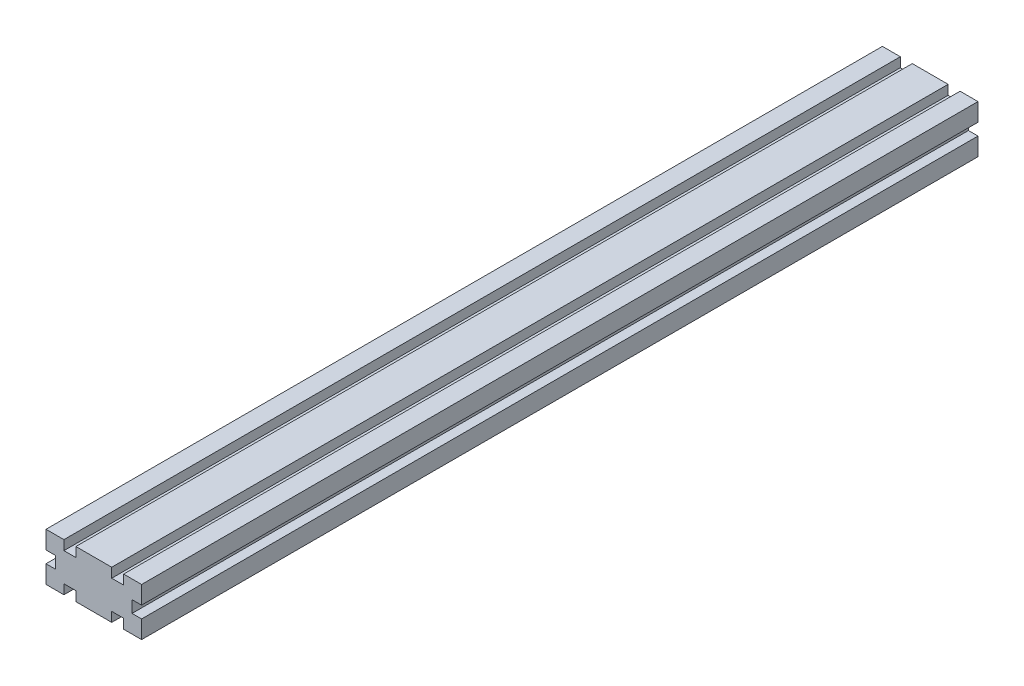
ISO-10303-21;
HEADER;
FILE_DESCRIPTION(('STEP AP214'),'2;1');
FILE_NAME('part.step','',(''),(''),'','','');
FILE_SCHEMA(('AUTOMOTIVE_DESIGN { 1 0 10303 214 1 1 1 1 }'));
ENDSEC;
DATA;
#1=APPLICATION_CONTEXT('core data for automotive mechanical design processes');
#2=APPLICATION_PROTOCOL_DEFINITION('international standard','automotive_design',2000,#1);
#3=PRODUCT_CONTEXT('',#1,'mechanical');
#4=PRODUCT('Part','Part','',(#3));
#5=PRODUCT_RELATED_PRODUCT_CATEGORY('part','',(#4));
#6=PRODUCT_DEFINITION_FORMATION('','',#4);
#7=PRODUCT_DEFINITION_CONTEXT('part definition',#1,'design');
#8=PRODUCT_DEFINITION('design','',#6,#7);
#9=PRODUCT_DEFINITION_SHAPE('','',#8);
#10=(LENGTH_UNIT() NAMED_UNIT(*) SI_UNIT(.MILLI.,.METRE.));
#11=(NAMED_UNIT(*) PLANE_ANGLE_UNIT() SI_UNIT($,.RADIAN.));
#12=(NAMED_UNIT(*) SI_UNIT($,.STERADIAN.) SOLID_ANGLE_UNIT());
#13=UNCERTAINTY_MEASURE_WITH_UNIT(LENGTH_MEASURE(1.E-05),#10,'distance_accuracy_value','');
#14=(GEOMETRIC_REPRESENTATION_CONTEXT(3) GLOBAL_UNCERTAINTY_ASSIGNED_CONTEXT((#13)) GLOBAL_UNIT_ASSIGNED_CONTEXT((#10,
#11,#12)) REPRESENTATION_CONTEXT('',''));
#15=CARTESIAN_POINT('',(0.,0.,0.));
#16=DIRECTION('',(0.,0.,1.));
#17=DIRECTION('',(1.,0.,0.));
#18=AXIS2_PLACEMENT_3D('',#15,#16,#17);
#19=CARTESIAN_POINT('',(40.,0.,350.));
#20=DIRECTION('',(-1.,0.,0.));
#21=DIRECTION('',(0.,0.,1.));
#22=AXIS2_PLACEMENT_3D('',#19,#20,#21);
#23=PLANE('',#22);
#24=DIRECTION('',(0.,1.,0.));
#25=VECTOR('',#24,1.);
#26=CARTESIAN_POINT('',(40.,0.,0.));
#27=LINE('',#26,#25);
#28=CARTESIAN_POINT('',(40.,12.5,0.));
#29=VERTEX_POINT('',#28);
#30=CARTESIAN_POINT('',(40.,20.,0.));
#31=VERTEX_POINT('',#30);
#32=EDGE_CURVE('E252',#29,#31,#27,.T.);
#33=ORIENTED_EDGE('',*,*,#32,.T.);
#34=DIRECTION('',(0.,0.,-1.));
#35=VECTOR('',#34,1.);
#36=CARTESIAN_POINT('',(40.,20.,350.));
#37=LINE('',#36,#35);
#38=CARTESIAN_POINT('',(40.,20.,350.));
#39=VERTEX_POINT('',#38);
#40=EDGE_CURVE('E11',#39,#31,#37,.T.);
#41=ORIENTED_EDGE('',*,*,#40,.F.);
#42=DIRECTION('',(0.,1.,0.));
#43=VECTOR('',#42,1.);
#44=CARTESIAN_POINT('',(40.,0.,350.));
#45=LINE('',#44,#43);
#46=CARTESIAN_POINT('',(40.,12.5,350.));
#47=VERTEX_POINT('',#46);
#48=EDGE_CURVE('E151',#47,#39,#45,.T.);
#49=ORIENTED_EDGE('',*,*,#48,.F.);
#50=DIRECTION('',(0.,0.,-1.));
#51=VECTOR('',#50,1.);
#52=CARTESIAN_POINT('',(40.,12.5,350.));
#53=LINE('',#52,#51);
#54=EDGE_CURVE('E251',#47,#29,#53,.T.);
#55=ORIENTED_EDGE('',*,*,#54,.T.);
#56=EDGE_LOOP('',(#33,#41,#49,#55));
#57=FACE_BOUND('',#56,.T.);
#58=ADVANCED_FACE('F36',(#57),#23,.F.);
#59=CARTESIAN_POINT('',(0.,20.,350.));
#60=DIRECTION('',(0.,1.,0.));
#61=DIRECTION('',(0.,0.,1.));
#62=AXIS2_PLACEMENT_3D('',#59,#60,#61);
#63=PLANE('',#62);
#64=DIRECTION('',(1.,0.,0.));
#65=VECTOR('',#64,1.);
#66=CARTESIAN_POINT('',(0.,20.,0.));
#67=LINE('',#66,#65);
#68=CARTESIAN_POINT('',(32.5,20.,0.));
#69=VERTEX_POINT('',#68);
#70=EDGE_CURVE('E255',#69,#31,#67,.T.);
#71=ORIENTED_EDGE('',*,*,#70,.F.);
#72=DIRECTION('',(0.,0.,-1.));
#73=VECTOR('',#72,1.);
#74=CARTESIAN_POINT('',(32.5,20.,350.));
#75=LINE('',#74,#73);
#76=CARTESIAN_POINT('',(32.5,20.,350.));
#77=VERTEX_POINT('',#76);
#78=EDGE_CURVE('E44',#77,#69,#75,.T.);
#79=ORIENTED_EDGE('',*,*,#78,.F.);
#80=DIRECTION('',(1.,0.,0.));
#81=VECTOR('',#80,1.);
#82=CARTESIAN_POINT('',(0.,20.,350.));
#83=LINE('',#82,#81);
#84=EDGE_CURVE('E397',#77,#39,#83,.T.);
#85=ORIENTED_EDGE('',*,*,#84,.T.);
#86=ORIENTED_EDGE('',*,*,#40,.T.);
#87=EDGE_LOOP('',(#71,#79,#85,#86));
#88=FACE_BOUND('',#87,.T.);
#89=ADVANCED_FACE('F385',(#88),#63,.T.);
#90=CARTESIAN_POINT('',(32.5,0.,350.));
#91=DIRECTION('',(-1.,0.,0.));
#92=DIRECTION('',(0.,0.,1.));
#93=AXIS2_PLACEMENT_3D('',#90,#91,#92);
#94=PLANE('',#93);
#95=DIRECTION('',(0.,1.,0.));
#96=VECTOR('',#95,1.);
#97=CARTESIAN_POINT('',(32.5,0.,0.));
#98=LINE('',#97,#96);
#99=CARTESIAN_POINT('',(32.5,16.,0.));
#100=VERTEX_POINT('',#99);
#101=EDGE_CURVE('E258',#100,#69,#98,.T.);
#102=ORIENTED_EDGE('',*,*,#101,.F.);
#103=DIRECTION('',(0.,0.,-1.));
#104=VECTOR('',#103,1.);
#105=CARTESIAN_POINT('',(32.5,16.,350.));
#106=LINE('',#105,#104);
#107=CARTESIAN_POINT('',(32.5,16.,350.));
#108=VERTEX_POINT('',#107);
#109=EDGE_CURVE('E375',#108,#100,#106,.T.);
#110=ORIENTED_EDGE('',*,*,#109,.F.);
#111=DIRECTION('',(0.,1.,0.));
#112=VECTOR('',#111,1.);
#113=CARTESIAN_POINT('',(32.5,0.,350.));
#114=LINE('',#113,#112);
#115=EDGE_CURVE('E382',#108,#77,#114,.T.);
#116=ORIENTED_EDGE('',*,*,#115,.T.);
#117=ORIENTED_EDGE('',*,*,#78,.T.);
#118=EDGE_LOOP('',(#102,#110,#116,#117));
#119=FACE_BOUND('',#118,.T.);
#120=ADVANCED_FACE('F380',(#119),#94,.T.);
#121=CARTESIAN_POINT('',(0.,16.,350.));
#122=DIRECTION('',(0.,1.,0.));
#123=DIRECTION('',(0.,0.,1.));
#124=AXIS2_PLACEMENT_3D('',#121,#122,#123);
#125=PLANE('',#124);
#126=DIRECTION('',(1.,0.,0.));
#127=VECTOR('',#126,1.);
#128=CARTESIAN_POINT('',(0.,16.,0.));
#129=LINE('',#128,#127);
#130=CARTESIAN_POINT('',(27.5,16.,0.));
#131=VERTEX_POINT('',#130);
#132=EDGE_CURVE('E261',#131,#100,#129,.T.);
#133=ORIENTED_EDGE('',*,*,#132,.F.);
#134=DIRECTION('',(0.,0.,-1.));
#135=VECTOR('',#134,1.);
#136=CARTESIAN_POINT('',(27.5,16.,350.));
#137=LINE('',#136,#135);
#138=CARTESIAN_POINT('',(27.5,16.,350.));
#139=VERTEX_POINT('',#138);
#140=EDGE_CURVE('E373',#139,#131,#137,.T.);
#141=ORIENTED_EDGE('',*,*,#140,.F.);
#142=DIRECTION('',(1.,0.,0.));
#143=VECTOR('',#142,1.);
#144=CARTESIAN_POINT('',(0.,16.,350.));
#145=LINE('',#144,#143);
#146=EDGE_CURVE('E396',#139,#108,#145,.T.);
#147=ORIENTED_EDGE('',*,*,#146,.T.);
#148=ORIENTED_EDGE('',*,*,#109,.T.);
#149=EDGE_LOOP('',(#133,#141,#147,#148));
#150=FACE_BOUND('',#149,.T.);
#151=ADVANCED_FACE('F392',(#150),#125,.T.);
#152=CARTESIAN_POINT('',(27.5,0.,350.));
#153=DIRECTION('',(-1.,0.,0.));
#154=DIRECTION('',(0.,0.,1.));
#155=AXIS2_PLACEMENT_3D('',#152,#153,#154);
#156=PLANE('',#155);
#157=DIRECTION('',(0.,1.,0.));
#158=VECTOR('',#157,1.);
#159=CARTESIAN_POINT('',(27.5,0.,0.));
#160=LINE('',#159,#158);
#161=CARTESIAN_POINT('',(27.5,20.,0.));
#162=VERTEX_POINT('',#161);
#163=EDGE_CURVE('E264',#131,#162,#160,.T.);
#164=ORIENTED_EDGE('',*,*,#163,.T.);
#165=DIRECTION('',(0.,0.,-1.));
#166=VECTOR('',#165,1.);
#167=CARTESIAN_POINT('',(27.5,20.,350.));
#168=LINE('',#167,#166);
#169=CARTESIAN_POINT('',(27.5,20.,350.));
#170=VERTEX_POINT('',#169);
#171=EDGE_CURVE('E371',#170,#162,#168,.T.);
#172=ORIENTED_EDGE('',*,*,#171,.F.);
#173=DIRECTION('',(0.,1.,0.));
#174=VECTOR('',#173,1.);
#175=CARTESIAN_POINT('',(27.5,0.,350.));
#176=LINE('',#175,#174);
#177=EDGE_CURVE('E399',#139,#170,#176,.T.);
#178=ORIENTED_EDGE('',*,*,#177,.F.);
#179=ORIENTED_EDGE('',*,*,#140,.T.);
#180=EDGE_LOOP('',(#164,#172,#178,#179));
#181=FACE_BOUND('',#180,.T.);
#182=ADVANCED_FACE('F481',(#181),#156,.F.);
#183=CARTESIAN_POINT('',(0.,20.,350.));
#184=DIRECTION('',(0.,1.,0.));
#185=DIRECTION('',(0.,0.,1.));
#186=AXIS2_PLACEMENT_3D('',#183,#184,#185);
#187=PLANE('',#186);
#188=DIRECTION('',(1.,0.,0.));
#189=VECTOR('',#188,1.);
#190=CARTESIAN_POINT('',(0.,20.,0.));
#191=LINE('',#190,#189);
#192=CARTESIAN_POINT('',(12.5,20.,0.));
#193=VERTEX_POINT('',#192);
#194=EDGE_CURVE('E267',#193,#162,#191,.T.);
#195=ORIENTED_EDGE('',*,*,#194,.F.);
#196=DIRECTION('',(0.,0.,-1.));
#197=VECTOR('',#196,1.);
#198=CARTESIAN_POINT('',(12.5,20.,350.));
#199=LINE('',#198,#197);
#200=CARTESIAN_POINT('',(12.5,20.,350.));
#201=VERTEX_POINT('',#200);
#202=EDGE_CURVE('E369',#201,#193,#199,.T.);
#203=ORIENTED_EDGE('',*,*,#202,.F.);
#204=DIRECTION('',(1.,0.,0.));
#205=VECTOR('',#204,1.);
#206=CARTESIAN_POINT('',(0.,20.,350.));
#207=LINE('',#206,#205);
#208=EDGE_CURVE('E405',#201,#170,#207,.T.);
#209=ORIENTED_EDGE('',*,*,#208,.T.);
#210=ORIENTED_EDGE('',*,*,#171,.T.);
#211=EDGE_LOOP('',(#195,#203,#209,#210));
#212=FACE_BOUND('',#211,.T.);
#213=ADVANCED_FACE('F484',(#212),#187,.T.);
#214=CARTESIAN_POINT('',(12.5,0.,350.));
#215=DIRECTION('',(-1.,0.,0.));
#216=DIRECTION('',(0.,0.,1.));
#217=AXIS2_PLACEMENT_3D('',#214,#215,#216);
#218=PLANE('',#217);
#219=DIRECTION('',(0.,1.,0.));
#220=VECTOR('',#219,1.);
#221=CARTESIAN_POINT('',(12.5,0.,0.));
#222=LINE('',#221,#220);
#223=CARTESIAN_POINT('',(12.5,16.,0.));
#224=VERTEX_POINT('',#223);
#225=EDGE_CURVE('E270',#224,#193,#222,.T.);
#226=ORIENTED_EDGE('',*,*,#225,.F.);
#227=DIRECTION('',(0.,0.,-1.));
#228=VECTOR('',#227,1.);
#229=CARTESIAN_POINT('',(12.5,16.,350.));
#230=LINE('',#229,#228);
#231=CARTESIAN_POINT('',(12.5,16.,350.));
#232=VERTEX_POINT('',#231);
#233=EDGE_CURVE('E367',#232,#224,#230,.T.);
#234=ORIENTED_EDGE('',*,*,#233,.F.);
#235=DIRECTION('',(0.,1.,0.));
#236=VECTOR('',#235,1.);
#237=CARTESIAN_POINT('',(12.5,0.,350.));
#238=LINE('',#237,#236);
#239=EDGE_CURVE('E408',#232,#201,#238,.T.);
#240=ORIENTED_EDGE('',*,*,#239,.T.);
#241=ORIENTED_EDGE('',*,*,#202,.T.);
#242=EDGE_LOOP('',(#226,#234,#240,#241));
#243=FACE_BOUND('',#242,.T.);
#244=ADVANCED_FACE('F488',(#243),#218,.T.);
#245=CARTESIAN_POINT('',(0.,16.,350.));
#246=DIRECTION('',(0.,1.,0.));
#247=DIRECTION('',(0.,0.,1.));
#248=AXIS2_PLACEMENT_3D('',#245,#246,#247);
#249=PLANE('',#248);
#250=DIRECTION('',(1.,0.,0.));
#251=VECTOR('',#250,1.);
#252=CARTESIAN_POINT('',(0.,16.,0.));
#253=LINE('',#252,#251);
#254=CARTESIAN_POINT('',(7.5,16.,0.));
#255=VERTEX_POINT('',#254);
#256=EDGE_CURVE('E273',#255,#224,#253,.T.);
#257=ORIENTED_EDGE('',*,*,#256,.F.);
#258=DIRECTION('',(0.,0.,-1.));
#259=VECTOR('',#258,1.);
#260=CARTESIAN_POINT('',(7.5,16.,350.));
#261=LINE('',#260,#259);
#262=CARTESIAN_POINT('',(7.5,16.,350.));
#263=VERTEX_POINT('',#262);
#264=EDGE_CURVE('E365',#263,#255,#261,.T.);
#265=ORIENTED_EDGE('',*,*,#264,.F.);
#266=DIRECTION('',(1.,0.,0.));
#267=VECTOR('',#266,1.);
#268=CARTESIAN_POINT('',(0.,16.,350.));
#269=LINE('',#268,#267);
#270=EDGE_CURVE('E411',#263,#232,#269,.T.);
#271=ORIENTED_EDGE('',*,*,#270,.T.);
#272=ORIENTED_EDGE('',*,*,#233,.T.);
#273=EDGE_LOOP('',(#257,#265,#271,#272));
#274=FACE_BOUND('',#273,.T.);
#275=ADVANCED_FACE('F492',(#274),#249,.T.);
#276=CARTESIAN_POINT('',(7.5,0.,350.));
#277=DIRECTION('',(-1.,0.,0.));
#278=DIRECTION('',(0.,0.,1.));
#279=AXIS2_PLACEMENT_3D('',#276,#277,#278);
#280=PLANE('',#279);
#281=DIRECTION('',(0.,1.,0.));
#282=VECTOR('',#281,1.);
#283=CARTESIAN_POINT('',(7.5,0.,0.));
#284=LINE('',#283,#282);
#285=CARTESIAN_POINT('',(7.5,20.,0.));
#286=VERTEX_POINT('',#285);
#287=EDGE_CURVE('E276',#255,#286,#284,.T.);
#288=ORIENTED_EDGE('',*,*,#287,.T.);
#289=DIRECTION('',(0.,0.,-1.));
#290=VECTOR('',#289,1.);
#291=CARTESIAN_POINT('',(7.5,20.,350.));
#292=LINE('',#291,#290);
#293=CARTESIAN_POINT('',(7.5,20.,350.));
#294=VERTEX_POINT('',#293);
#295=EDGE_CURVE('E363',#294,#286,#292,.T.);
#296=ORIENTED_EDGE('',*,*,#295,.F.);
#297=DIRECTION('',(0.,1.,0.));
#298=VECTOR('',#297,1.);
#299=CARTESIAN_POINT('',(7.5,0.,350.));
#300=LINE('',#299,#298);
#301=EDGE_CURVE('E414',#263,#294,#300,.T.);
#302=ORIENTED_EDGE('',*,*,#301,.F.);
#303=ORIENTED_EDGE('',*,*,#264,.T.);
#304=EDGE_LOOP('',(#288,#296,#302,#303));
#305=FACE_BOUND('',#304,.T.);
#306=ADVANCED_FACE('F496',(#305),#280,.F.);
#307=CARTESIAN_POINT('',(0.,20.,350.));
#308=DIRECTION('',(0.,1.,0.));
#309=DIRECTION('',(0.,0.,1.));
#310=AXIS2_PLACEMENT_3D('',#307,#308,#309);
#311=PLANE('',#310);
#312=DIRECTION('',(1.,0.,0.));
#313=VECTOR('',#312,1.);
#314=CARTESIAN_POINT('',(0.,20.,0.));
#315=LINE('',#314,#313);
#316=CARTESIAN_POINT('',(0.,20.,0.));
#317=VERTEX_POINT('',#316);
#318=EDGE_CURVE('E279',#317,#286,#315,.T.);
#319=ORIENTED_EDGE('',*,*,#318,.F.);
#320=DIRECTION('',(0.,0.,-1.));
#321=VECTOR('',#320,1.);
#322=CARTESIAN_POINT('',(0.,20.,350.));
#323=LINE('',#322,#321);
#324=CARTESIAN_POINT('',(0.,20.,350.));
#325=VERTEX_POINT('',#324);
#326=EDGE_CURVE('E361',#325,#317,#323,.T.);
#327=ORIENTED_EDGE('',*,*,#326,.F.);
#328=DIRECTION('',(1.,0.,0.));
#329=VECTOR('',#328,1.);
#330=CARTESIAN_POINT('',(0.,20.,350.));
#331=LINE('',#330,#329);
#332=EDGE_CURVE('E416',#325,#294,#331,.T.);
#333=ORIENTED_EDGE('',*,*,#332,.T.);
#334=ORIENTED_EDGE('',*,*,#295,.T.);
#335=EDGE_LOOP('',(#319,#327,#333,#334));
#336=FACE_BOUND('',#335,.T.);
#337=ADVANCED_FACE('F500',(#336),#311,.T.);
#338=CARTESIAN_POINT('',(0.,0.,350.));
#339=DIRECTION('',(-1.,0.,0.));
#340=DIRECTION('',(0.,0.,1.));
#341=AXIS2_PLACEMENT_3D('',#338,#339,#340);
#342=PLANE('',#341);
#343=DIRECTION('',(0.,1.,0.));
#344=VECTOR('',#343,1.);
#345=CARTESIAN_POINT('',(0.,0.,0.));
#346=LINE('',#345,#344);
#347=CARTESIAN_POINT('',(0.,12.5,0.));
#348=VERTEX_POINT('',#347);
#349=EDGE_CURVE('E282',#348,#317,#346,.T.);
#350=ORIENTED_EDGE('',*,*,#349,.F.);
#351=DIRECTION('',(0.,0.,-1.));
#352=VECTOR('',#351,1.);
#353=CARTESIAN_POINT('',(0.,12.5,350.));
#354=LINE('',#353,#352);
#355=CARTESIAN_POINT('',(0.,12.5,350.));
#356=VERTEX_POINT('',#355);
#357=EDGE_CURVE('E359',#356,#348,#354,.T.);
#358=ORIENTED_EDGE('',*,*,#357,.F.);
#359=DIRECTION('',(0.,1.,0.));
#360=VECTOR('',#359,1.);
#361=CARTESIAN_POINT('',(0.,0.,350.));
#362=LINE('',#361,#360);
#363=EDGE_CURVE('E419',#356,#325,#362,.T.);
#364=ORIENTED_EDGE('',*,*,#363,.T.);
#365=ORIENTED_EDGE('',*,*,#326,.T.);
#366=EDGE_LOOP('',(#350,#358,#364,#365));
#367=FACE_BOUND('',#366,.T.);
#368=ADVANCED_FACE('F504',(#367),#342,.T.);
#369=CARTESIAN_POINT('',(0.,12.5,350.));
#370=DIRECTION('',(0.,1.,0.));
#371=DIRECTION('',(-1.,0.,0.));
#372=AXIS2_PLACEMENT_3D('',#369,#370,#371);
#373=PLANE('',#372);
#374=DIRECTION('',(1.,0.,0.));
#375=VECTOR('',#374,1.);
#376=CARTESIAN_POINT('',(0.,12.5,0.));
#377=LINE('',#376,#375);
#378=CARTESIAN_POINT('',(4.,12.5,0.));
#379=VERTEX_POINT('',#378);
#380=EDGE_CURVE('E285',#348,#379,#377,.T.);
#381=ORIENTED_EDGE('',*,*,#380,.T.);
#382=DIRECTION('',(0.,0.,-1.));
#383=VECTOR('',#382,1.);
#384=CARTESIAN_POINT('',(4.,12.5,350.));
#385=LINE('',#384,#383);
#386=CARTESIAN_POINT('',(4.,12.5,350.));
#387=VERTEX_POINT('',#386);
#388=EDGE_CURVE('E357',#387,#379,#385,.T.);
#389=ORIENTED_EDGE('',*,*,#388,.F.);
#390=DIRECTION('',(1.,0.,0.));
#391=VECTOR('',#390,1.);
#392=CARTESIAN_POINT('',(0.,12.5,350.));
#393=LINE('',#392,#391);
#394=EDGE_CURVE('E422',#356,#387,#393,.T.);
#395=ORIENTED_EDGE('',*,*,#394,.F.);
#396=ORIENTED_EDGE('',*,*,#357,.T.);
#397=EDGE_LOOP('',(#381,#389,#395,#396));
#398=FACE_BOUND('',#397,.T.);
#399=ADVANCED_FACE('F508',(#398),#373,.F.);
#400=CARTESIAN_POINT('',(4.,0.,350.));
#401=DIRECTION('',(-1.,0.,0.));
#402=DIRECTION('',(0.,0.,1.));
#403=AXIS2_PLACEMENT_3D('',#400,#401,#402);
#404=PLANE('',#403);
#405=DIRECTION('',(0.,1.,0.));
#406=VECTOR('',#405,1.);
#407=CARTESIAN_POINT('',(4.,0.,0.));
#408=LINE('',#407,#406);
#409=CARTESIAN_POINT('',(4.,7.5,0.));
#410=VERTEX_POINT('',#409);
#411=EDGE_CURVE('E288',#410,#379,#408,.T.);
#412=ORIENTED_EDGE('',*,*,#411,.F.);
#413=DIRECTION('',(0.,0.,-1.));
#414=VECTOR('',#413,1.);
#415=CARTESIAN_POINT('',(4.,7.5,350.));
#416=LINE('',#415,#414);
#417=CARTESIAN_POINT('',(4.,7.5,350.));
#418=VERTEX_POINT('',#417);
#419=EDGE_CURVE('E355',#418,#410,#416,.T.);
#420=ORIENTED_EDGE('',*,*,#419,.F.);
#421=DIRECTION('',(0.,1.,0.));
#422=VECTOR('',#421,1.);
#423=CARTESIAN_POINT('',(4.,0.,350.));
#424=LINE('',#423,#422);
#425=EDGE_CURVE('E424',#418,#387,#424,.T.);
#426=ORIENTED_EDGE('',*,*,#425,.T.);
#427=ORIENTED_EDGE('',*,*,#388,.T.);
#428=EDGE_LOOP('',(#412,#420,#426,#427));
#429=FACE_BOUND('',#428,.T.);
#430=ADVANCED_FACE('F512',(#429),#404,.T.);
#431=CARTESIAN_POINT('',(0.,7.5,350.));
#432=DIRECTION('',(0.,1.,0.));
#433=DIRECTION('',(-1.,0.,0.));
#434=AXIS2_PLACEMENT_3D('',#431,#432,#433);
#435=PLANE('',#434);
#436=DIRECTION('',(1.,0.,0.));
#437=VECTOR('',#436,1.);
#438=CARTESIAN_POINT('',(0.,7.5,0.));
#439=LINE('',#438,#437);
#440=CARTESIAN_POINT('',(0.,7.5,0.));
#441=VERTEX_POINT('',#440);
#442=EDGE_CURVE('E291',#441,#410,#439,.T.);
#443=ORIENTED_EDGE('',*,*,#442,.F.);
#444=DIRECTION('',(0.,0.,-1.));
#445=VECTOR('',#444,1.);
#446=CARTESIAN_POINT('',(0.,7.5,350.));
#447=LINE('',#446,#445);
#448=CARTESIAN_POINT('',(0.,7.5,350.));
#449=VERTEX_POINT('',#448);
#450=EDGE_CURVE('E353',#449,#441,#447,.T.);
#451=ORIENTED_EDGE('',*,*,#450,.F.);
#452=DIRECTION('',(1.,0.,0.));
#453=VECTOR('',#452,1.);
#454=CARTESIAN_POINT('',(0.,7.5,350.));
#455=LINE('',#454,#453);
#456=EDGE_CURVE('E427',#449,#418,#455,.T.);
#457=ORIENTED_EDGE('',*,*,#456,.T.);
#458=ORIENTED_EDGE('',*,*,#419,.T.);
#459=EDGE_LOOP('',(#443,#451,#457,#458));
#460=FACE_BOUND('',#459,.T.);
#461=ADVANCED_FACE('F516',(#460),#435,.T.);
#462=CARTESIAN_POINT('',(0.,0.,350.));
#463=DIRECTION('',(-1.,0.,0.));
#464=DIRECTION('',(0.,0.,1.));
#465=AXIS2_PLACEMENT_3D('',#462,#463,#464);
#466=PLANE('',#465);
#467=DIRECTION('',(0.,1.,0.));
#468=VECTOR('',#467,1.);
#469=CARTESIAN_POINT('',(0.,0.,0.));
#470=LINE('',#469,#468);
#471=CARTESIAN_POINT('',(0.,0.,0.));
#472=VERTEX_POINT('',#471);
#473=EDGE_CURVE('E294',#472,#441,#470,.T.);
#474=ORIENTED_EDGE('',*,*,#473,.F.);
#475=DIRECTION('',(0.,0.,-1.));
#476=VECTOR('',#475,1.);
#477=CARTESIAN_POINT('',(0.,0.,350.));
#478=LINE('',#477,#476);
#479=CARTESIAN_POINT('',(0.,0.,350.));
#480=VERTEX_POINT('',#479);
#481=EDGE_CURVE('E351',#480,#472,#478,.T.);
#482=ORIENTED_EDGE('',*,*,#481,.F.);
#483=DIRECTION('',(0.,1.,0.));
#484=VECTOR('',#483,1.);
#485=CARTESIAN_POINT('',(0.,0.,350.));
#486=LINE('',#485,#484);
#487=EDGE_CURVE('E430',#480,#449,#486,.T.);
#488=ORIENTED_EDGE('',*,*,#487,.T.);
#489=ORIENTED_EDGE('',*,*,#450,.T.);
#490=EDGE_LOOP('',(#474,#482,#488,#489));
#491=FACE_BOUND('',#490,.T.);
#492=ADVANCED_FACE('F520',(#491),#466,.T.);
#493=CARTESIAN_POINT('',(0.,0.,350.));
#494=DIRECTION('',(0.,1.,0.));
#495=DIRECTION('',(0.,0.,1.));
#496=AXIS2_PLACEMENT_3D('',#493,#494,#495);
#497=PLANE('',#496);
#498=DIRECTION('',(1.,0.,0.));
#499=VECTOR('',#498,1.);
#500=CARTESIAN_POINT('',(0.,0.,0.));
#501=LINE('',#500,#499);
#502=CARTESIAN_POINT('',(7.5,0.,0.));
#503=VERTEX_POINT('',#502);
#504=EDGE_CURVE('E297',#472,#503,#501,.T.);
#505=ORIENTED_EDGE('',*,*,#504,.T.);
#506=DIRECTION('',(0.,0.,-1.));
#507=VECTOR('',#506,1.);
#508=CARTESIAN_POINT('',(7.5,0.,350.));
#509=LINE('',#508,#507);
#510=CARTESIAN_POINT('',(7.5,0.,350.));
#511=VERTEX_POINT('',#510);
#512=EDGE_CURVE('E348',#511,#503,#509,.T.);
#513=ORIENTED_EDGE('',*,*,#512,.F.);
#514=DIRECTION('',(1.,0.,0.));
#515=VECTOR('',#514,1.);
#516=CARTESIAN_POINT('',(0.,0.,350.));
#517=LINE('',#516,#515);
#518=EDGE_CURVE('E433',#480,#511,#517,.T.);
#519=ORIENTED_EDGE('',*,*,#518,.F.);
#520=ORIENTED_EDGE('',*,*,#481,.T.);
#521=EDGE_LOOP('',(#505,#513,#519,#520));
#522=FACE_BOUND('',#521,.T.);
#523=ADVANCED_FACE('F524',(#522),#497,.F.);
#524=CARTESIAN_POINT('',(7.5,0.,350.));
#525=DIRECTION('',(-1.,0.,0.));
#526=DIRECTION('',(0.,0.,1.));
#527=AXIS2_PLACEMENT_3D('',#524,#525,#526);
#528=PLANE('',#527);
#529=DIRECTION('',(0.,1.,0.));
#530=VECTOR('',#529,1.);
#531=CARTESIAN_POINT('',(7.5,0.,0.));
#532=LINE('',#531,#530);
#533=CARTESIAN_POINT('',(7.5,4.,0.));
#534=VERTEX_POINT('',#533);
#535=EDGE_CURVE('E299',#503,#534,#532,.T.);
#536=ORIENTED_EDGE('',*,*,#535,.T.);
#537=DIRECTION('',(0.,0.,-1.));
#538=VECTOR('',#537,1.);
#539=CARTESIAN_POINT('',(7.5,4.,350.));
#540=LINE('',#539,#538);
#541=CARTESIAN_POINT('',(7.5,4.,350.));
#542=VERTEX_POINT('',#541);
#543=EDGE_CURVE('E345',#542,#534,#540,.T.);
#544=ORIENTED_EDGE('',*,*,#543,.F.);
#545=DIRECTION('',(0.,1.,0.));
#546=VECTOR('',#545,1.);
#547=CARTESIAN_POINT('',(7.5,0.,350.));
#548=LINE('',#547,#546);
#549=EDGE_CURVE('E435',#511,#542,#548,.T.);
#550=ORIENTED_EDGE('',*,*,#549,.F.);
#551=ORIENTED_EDGE('',*,*,#512,.T.);
#552=EDGE_LOOP('',(#536,#544,#550,#551));
#553=FACE_BOUND('',#552,.T.);
#554=ADVANCED_FACE('F528',(#553),#528,.F.);
#555=CARTESIAN_POINT('',(0.,4.,350.));
#556=DIRECTION('',(0.,1.,0.));
#557=DIRECTION('',(0.,0.,1.));
#558=AXIS2_PLACEMENT_3D('',#555,#556,#557);
#559=PLANE('',#558);
#560=DIRECTION('',(1.,0.,0.));
#561=VECTOR('',#560,1.);
#562=CARTESIAN_POINT('',(0.,4.,0.));
#563=LINE('',#562,#561);
#564=CARTESIAN_POINT('',(12.5,4.,0.));
#565=VERTEX_POINT('',#564);
#566=EDGE_CURVE('E301',#534,#565,#563,.T.);
#567=ORIENTED_EDGE('',*,*,#566,.T.);
#568=DIRECTION('',(0.,0.,-1.));
#569=VECTOR('',#568,1.);
#570=CARTESIAN_POINT('',(12.5,4.,350.));
#571=LINE('',#570,#569);
#572=CARTESIAN_POINT('',(12.5,4.,350.));
#573=VERTEX_POINT('',#572);
#574=EDGE_CURVE('E343',#573,#565,#571,.T.);
#575=ORIENTED_EDGE('',*,*,#574,.F.);
#576=DIRECTION('',(1.,0.,0.));
#577=VECTOR('',#576,1.);
#578=CARTESIAN_POINT('',(0.,4.,350.));
#579=LINE('',#578,#577);
#580=EDGE_CURVE('E437',#542,#573,#579,.T.);
#581=ORIENTED_EDGE('',*,*,#580,.F.);
#582=ORIENTED_EDGE('',*,*,#543,.T.);
#583=EDGE_LOOP('',(#567,#575,#581,#582));
#584=FACE_BOUND('',#583,.T.);
#585=ADVANCED_FACE('F532',(#584),#559,.F.);
#586=CARTESIAN_POINT('',(12.5,0.,350.));
#587=DIRECTION('',(-1.,0.,0.));
#588=DIRECTION('',(0.,0.,1.));
#589=AXIS2_PLACEMENT_3D('',#586,#587,#588);
#590=PLANE('',#589);
#591=DIRECTION('',(0.,1.,0.));
#592=VECTOR('',#591,1.);
#593=CARTESIAN_POINT('',(12.5,0.,0.));
#594=LINE('',#593,#592);
#595=CARTESIAN_POINT('',(12.5,0.,0.));
#596=VERTEX_POINT('',#595);
#597=EDGE_CURVE('E304',#596,#565,#594,.T.);
#598=ORIENTED_EDGE('',*,*,#597,.F.);
#599=DIRECTION('',(0.,0.,-1.));
#600=VECTOR('',#599,1.);
#601=CARTESIAN_POINT('',(12.5,0.,350.));
#602=LINE('',#601,#600);
#603=CARTESIAN_POINT('',(12.5,0.,350.));
#604=VERTEX_POINT('',#603);
#605=EDGE_CURVE('E341',#604,#596,#602,.T.);
#606=ORIENTED_EDGE('',*,*,#605,.F.);
#607=DIRECTION('',(0.,1.,0.));
#608=VECTOR('',#607,1.);
#609=CARTESIAN_POINT('',(12.5,0.,350.));
#610=LINE('',#609,#608);
#611=EDGE_CURVE('E439',#604,#573,#610,.T.);
#612=ORIENTED_EDGE('',*,*,#611,.T.);
#613=ORIENTED_EDGE('',*,*,#574,.T.);
#614=EDGE_LOOP('',(#598,#606,#612,#613));
#615=FACE_BOUND('',#614,.T.);
#616=ADVANCED_FACE('F536',(#615),#590,.T.);
#617=CARTESIAN_POINT('',(0.,0.,350.));
#618=DIRECTION('',(0.,1.,0.));
#619=DIRECTION('',(0.,0.,1.));
#620=AXIS2_PLACEMENT_3D('',#617,#618,#619);
#621=PLANE('',#620);
#622=DIRECTION('',(1.,0.,0.));
#623=VECTOR('',#622,1.);
#624=CARTESIAN_POINT('',(0.,0.,0.));
#625=LINE('',#624,#623);
#626=CARTESIAN_POINT('',(27.5,0.,0.));
#627=VERTEX_POINT('',#626);
#628=EDGE_CURVE('E307',#596,#627,#625,.T.);
#629=ORIENTED_EDGE('',*,*,#628,.T.);
#630=DIRECTION('',(0.,0.,-1.));
#631=VECTOR('',#630,1.);
#632=CARTESIAN_POINT('',(27.5,0.,350.));
#633=LINE('',#632,#631);
#634=CARTESIAN_POINT('',(27.5,0.,350.));
#635=VERTEX_POINT('',#634);
#636=EDGE_CURVE('E338',#635,#627,#633,.T.);
#637=ORIENTED_EDGE('',*,*,#636,.F.);
#638=DIRECTION('',(1.,0.,0.));
#639=VECTOR('',#638,1.);
#640=CARTESIAN_POINT('',(0.,0.,350.));
#641=LINE('',#640,#639);
#642=EDGE_CURVE('E442',#604,#635,#641,.T.);
#643=ORIENTED_EDGE('',*,*,#642,.F.);
#644=ORIENTED_EDGE('',*,*,#605,.T.);
#645=EDGE_LOOP('',(#629,#637,#643,#644));
#646=FACE_BOUND('',#645,.T.);
#647=ADVANCED_FACE('F540',(#646),#621,.F.);
#648=CARTESIAN_POINT('',(27.5,0.,350.));
#649=DIRECTION('',(-1.,0.,0.));
#650=DIRECTION('',(0.,0.,1.));
#651=AXIS2_PLACEMENT_3D('',#648,#649,#650);
#652=PLANE('',#651);
#653=DIRECTION('',(0.,1.,0.));
#654=VECTOR('',#653,1.);
#655=CARTESIAN_POINT('',(27.5,0.,0.));
#656=LINE('',#655,#654);
#657=CARTESIAN_POINT('',(27.5,3.99999999999999,0.));
#658=VERTEX_POINT('',#657);
#659=EDGE_CURVE('E309',#627,#658,#656,.T.);
#660=ORIENTED_EDGE('',*,*,#659,.T.);
#661=DIRECTION('',(0.,0.,-1.));
#662=VECTOR('',#661,1.);
#663=CARTESIAN_POINT('',(27.5,3.99999999999999,350.));
#664=LINE('',#663,#662);
#665=CARTESIAN_POINT('',(27.5,3.99999999999999,350.));
#666=VERTEX_POINT('',#665);
#667=EDGE_CURVE('E335',#666,#658,#664,.T.);
#668=ORIENTED_EDGE('',*,*,#667,.F.);
#669=DIRECTION('',(0.,1.,0.));
#670=VECTOR('',#669,1.);
#671=CARTESIAN_POINT('',(27.5,0.,350.));
#672=LINE('',#671,#670);
#673=EDGE_CURVE('E444',#635,#666,#672,.T.);
#674=ORIENTED_EDGE('',*,*,#673,.F.);
#675=ORIENTED_EDGE('',*,*,#636,.T.);
#676=EDGE_LOOP('',(#660,#668,#674,#675));
#677=FACE_BOUND('',#676,.T.);
#678=ADVANCED_FACE('F544',(#677),#652,.F.);
#679=CARTESIAN_POINT('',(0.,3.99999999999999,350.));
#680=DIRECTION('',(0.,1.,0.));
#681=DIRECTION('',(0.,0.,1.));
#682=AXIS2_PLACEMENT_3D('',#679,#680,#681);
#683=PLANE('',#682);
#684=DIRECTION('',(1.,0.,0.));
#685=VECTOR('',#684,1.);
#686=CARTESIAN_POINT('',(0.,3.99999999999999,0.));
#687=LINE('',#686,#685);
#688=CARTESIAN_POINT('',(32.5,3.99999999999999,0.));
#689=VERTEX_POINT('',#688);
#690=EDGE_CURVE('E311',#658,#689,#687,.T.);
#691=ORIENTED_EDGE('',*,*,#690,.T.);
#692=DIRECTION('',(0.,0.,-1.));
#693=VECTOR('',#692,1.);
#694=CARTESIAN_POINT('',(32.5,3.99999999999999,350.));
#695=LINE('',#694,#693);
#696=CARTESIAN_POINT('',(32.5,3.99999999999999,350.));
#697=VERTEX_POINT('',#696);
#698=EDGE_CURVE('E333',#697,#689,#695,.T.);
#699=ORIENTED_EDGE('',*,*,#698,.F.);
#700=DIRECTION('',(1.,0.,0.));
#701=VECTOR('',#700,1.);
#702=CARTESIAN_POINT('',(0.,3.99999999999999,350.));
#703=LINE('',#702,#701);
#704=EDGE_CURVE('E446',#666,#697,#703,.T.);
#705=ORIENTED_EDGE('',*,*,#704,.F.);
#706=ORIENTED_EDGE('',*,*,#667,.T.);
#707=EDGE_LOOP('',(#691,#699,#705,#706));
#708=FACE_BOUND('',#707,.T.);
#709=ADVANCED_FACE('F548',(#708),#683,.F.);
#710=CARTESIAN_POINT('',(32.5,0.,350.));
#711=DIRECTION('',(-1.,0.,0.));
#712=DIRECTION('',(0.,0.,1.));
#713=AXIS2_PLACEMENT_3D('',#710,#711,#712);
#714=PLANE('',#713);
#715=DIRECTION('',(0.,1.,0.));
#716=VECTOR('',#715,1.);
#717=CARTESIAN_POINT('',(32.5,0.,0.));
#718=LINE('',#717,#716);
#719=CARTESIAN_POINT('',(32.5,0.,0.));
#720=VERTEX_POINT('',#719);
#721=EDGE_CURVE('E314',#720,#689,#718,.T.);
#722=ORIENTED_EDGE('',*,*,#721,.F.);
#723=DIRECTION('',(0.,0.,-1.));
#724=VECTOR('',#723,1.);
#725=CARTESIAN_POINT('',(32.5,0.,350.));
#726=LINE('',#725,#724);
#727=CARTESIAN_POINT('',(32.5,0.,350.));
#728=VERTEX_POINT('',#727);
#729=EDGE_CURVE('E331',#728,#720,#726,.T.);
#730=ORIENTED_EDGE('',*,*,#729,.F.);
#731=DIRECTION('',(0.,1.,0.));
#732=VECTOR('',#731,1.);
#733=CARTESIAN_POINT('',(32.5,0.,350.));
#734=LINE('',#733,#732);
#735=EDGE_CURVE('E448',#728,#697,#734,.T.);
#736=ORIENTED_EDGE('',*,*,#735,.T.);
#737=ORIENTED_EDGE('',*,*,#698,.T.);
#738=EDGE_LOOP('',(#722,#730,#736,#737));
#739=FACE_BOUND('',#738,.T.);
#740=ADVANCED_FACE('F552',(#739),#714,.T.);
#741=CARTESIAN_POINT('',(0.,0.,350.));
#742=DIRECTION('',(0.,1.,0.));
#743=DIRECTION('',(0.,0.,1.));
#744=AXIS2_PLACEMENT_3D('',#741,#742,#743);
#745=PLANE('',#744);
#746=DIRECTION('',(1.,0.,0.));
#747=VECTOR('',#746,1.);
#748=CARTESIAN_POINT('',(0.,0.,0.));
#749=LINE('',#748,#747);
#750=CARTESIAN_POINT('',(40.,0.,0.));
#751=VERTEX_POINT('',#750);
#752=EDGE_CURVE('E317',#720,#751,#749,.T.);
#753=ORIENTED_EDGE('',*,*,#752,.T.);
#754=DIRECTION('',(0.,0.,-1.));
#755=VECTOR('',#754,1.);
#756=CARTESIAN_POINT('',(40.,0.,350.));
#757=LINE('',#756,#755);
#758=CARTESIAN_POINT('',(40.,0.,350.));
#759=VERTEX_POINT('',#758);
#760=EDGE_CURVE('E328',#759,#751,#757,.T.);
#761=ORIENTED_EDGE('',*,*,#760,.F.);
#762=DIRECTION('',(1.,0.,0.));
#763=VECTOR('',#762,1.);
#764=CARTESIAN_POINT('',(0.,0.,350.));
#765=LINE('',#764,#763);
#766=EDGE_CURVE('E246',#728,#759,#765,.T.);
#767=ORIENTED_EDGE('',*,*,#766,.F.);
#768=ORIENTED_EDGE('',*,*,#729,.T.);
#769=EDGE_LOOP('',(#753,#761,#767,#768));
#770=FACE_BOUND('',#769,.T.);
#771=ADVANCED_FACE('F454',(#770),#745,.F.);
#772=CARTESIAN_POINT('',(40.,0.,350.));
#773=DIRECTION('',(-1.,0.,0.));
#774=DIRECTION('',(0.,0.,1.));
#775=AXIS2_PLACEMENT_3D('',#772,#773,#774);
#776=PLANE('',#775);
#777=DIRECTION('',(0.,1.,0.));
#778=VECTOR('',#777,1.);
#779=CARTESIAN_POINT('',(40.,0.,0.));
#780=LINE('',#779,#778);
#781=CARTESIAN_POINT('',(40.,7.5,0.));
#782=VERTEX_POINT('',#781);
#783=EDGE_CURVE('E319',#751,#782,#780,.T.);
#784=ORIENTED_EDGE('',*,*,#783,.T.);
#785=DIRECTION('',(0.,0.,-1.));
#786=VECTOR('',#785,1.);
#787=CARTESIAN_POINT('',(40.,7.5,350.));
#788=LINE('',#787,#786);
#789=CARTESIAN_POINT('',(40.,7.5,350.));
#790=VERTEX_POINT('',#789);
#791=EDGE_CURVE('E235',#790,#782,#788,.T.);
#792=ORIENTED_EDGE('',*,*,#791,.F.);
#793=DIRECTION('',(0.,1.,0.));
#794=VECTOR('',#793,1.);
#795=CARTESIAN_POINT('',(40.,0.,350.));
#796=LINE('',#795,#794);
#797=EDGE_CURVE('E243',#759,#790,#796,.T.);
#798=ORIENTED_EDGE('',*,*,#797,.F.);
#799=ORIENTED_EDGE('',*,*,#760,.T.);
#800=EDGE_LOOP('',(#784,#792,#798,#799));
#801=FACE_BOUND('',#800,.T.);
#802=ADVANCED_FACE('F458',(#801),#776,.F.);
#803=CARTESIAN_POINT('',(0.,7.5,350.));
#804=DIRECTION('',(0.,1.,0.));
#805=DIRECTION('',(-1.,0.,0.));
#806=AXIS2_PLACEMENT_3D('',#803,#804,#805);
#807=PLANE('',#806);
#808=DIRECTION('',(1.,0.,0.));
#809=VECTOR('',#808,1.);
#810=CARTESIAN_POINT('',(0.,7.5,0.));
#811=LINE('',#810,#809);
#812=CARTESIAN_POINT('',(36.,7.5,0.));
#813=VERTEX_POINT('',#812);
#814=EDGE_CURVE('E234',#813,#782,#811,.T.);
#815=ORIENTED_EDGE('',*,*,#814,.F.);
#816=DIRECTION('',(0.,0.,-1.));
#817=VECTOR('',#816,1.);
#818=CARTESIAN_POINT('',(36.,7.5,350.));
#819=LINE('',#818,#817);
#820=CARTESIAN_POINT('',(36.,7.5,350.));
#821=VERTEX_POINT('',#820);
#822=EDGE_CURVE('E228',#821,#813,#819,.T.);
#823=ORIENTED_EDGE('',*,*,#822,.F.);
#824=DIRECTION('',(1.,0.,0.));
#825=VECTOR('',#824,1.);
#826=CARTESIAN_POINT('',(0.,7.5,350.));
#827=LINE('',#826,#825);
#828=EDGE_CURVE('E232',#821,#790,#827,.T.);
#829=ORIENTED_EDGE('',*,*,#828,.T.);
#830=ORIENTED_EDGE('',*,*,#791,.T.);
#831=EDGE_LOOP('',(#815,#823,#829,#830));
#832=FACE_BOUND('',#831,.T.);
#833=ADVANCED_FACE('F230',(#832),#807,.T.);
#834=CARTESIAN_POINT('',(36.,0.,350.));
#835=DIRECTION('',(-1.,0.,0.));
#836=DIRECTION('',(0.,0.,1.));
#837=AXIS2_PLACEMENT_3D('',#834,#835,#836);
#838=PLANE('',#837);
#839=DIRECTION('',(0.,1.,0.));
#840=VECTOR('',#839,1.);
#841=CARTESIAN_POINT('',(36.,0.,0.));
#842=LINE('',#841,#840);
#843=CARTESIAN_POINT('',(36.,12.5,0.));
#844=VERTEX_POINT('',#843);
#845=EDGE_CURVE('E139',#813,#844,#842,.T.);
#846=ORIENTED_EDGE('',*,*,#845,.T.);
#847=DIRECTION('',(0.,0.,-1.));
#848=VECTOR('',#847,1.);
#849=CARTESIAN_POINT('',(36.,12.5,350.));
#850=LINE('',#849,#848);
#851=CARTESIAN_POINT('',(36.,12.5,350.));
#852=VERTEX_POINT('',#851);
#853=EDGE_CURVE('E236',#852,#844,#850,.T.);
#854=ORIENTED_EDGE('',*,*,#853,.F.);
#855=DIRECTION('',(0.,1.,0.));
#856=VECTOR('',#855,1.);
#857=CARTESIAN_POINT('',(36.,0.,350.));
#858=LINE('',#857,#856);
#859=EDGE_CURVE('E238',#821,#852,#858,.T.);
#860=ORIENTED_EDGE('',*,*,#859,.F.);
#861=ORIENTED_EDGE('',*,*,#822,.T.);
#862=EDGE_LOOP('',(#846,#854,#860,#861));
#863=FACE_BOUND('',#862,.T.);
#864=ADVANCED_FACE('F239',(#863),#838,.F.);
#865=CARTESIAN_POINT('',(0.,12.5,350.));
#866=DIRECTION('',(0.,1.,0.));
#867=DIRECTION('',(-1.,0.,0.));
#868=AXIS2_PLACEMENT_3D('',#865,#866,#867);
#869=PLANE('',#868);
#870=DIRECTION('',(1.,0.,0.));
#871=VECTOR('',#870,1.);
#872=CARTESIAN_POINT('',(0.,12.5,0.));
#873=LINE('',#872,#871);
#874=EDGE_CURVE('E145',#844,#29,#873,.T.);
#875=ORIENTED_EDGE('',*,*,#874,.T.);
#876=ORIENTED_EDGE('',*,*,#54,.F.);
#877=DIRECTION('',(1.,0.,0.));
#878=VECTOR('',#877,1.);
#879=CARTESIAN_POINT('',(0.,12.5,350.));
#880=LINE('',#879,#878);
#881=EDGE_CURVE('E52',#852,#47,#880,.T.);
#882=ORIENTED_EDGE('',*,*,#881,.F.);
#883=ORIENTED_EDGE('',*,*,#853,.T.);
#884=EDGE_LOOP('',(#875,#876,#882,#883));
#885=FACE_BOUND('',#884,.T.);
#886=ADVANCED_FACE('F460',(#885),#869,.F.);
#887=CARTESIAN_POINT('',(0.,0.,350.));
#888=DIRECTION('',(0.,0.,1.));
#889=DIRECTION('',(1.,0.,0.));
#890=AXIS2_PLACEMENT_3D('',#887,#888,#889);
#891=PLANE('',#890);
#892=ORIENTED_EDGE('',*,*,#48,.T.);
#893=ORIENTED_EDGE('',*,*,#84,.F.);
#894=ORIENTED_EDGE('',*,*,#115,.F.);
#895=ORIENTED_EDGE('',*,*,#146,.F.);
#896=ORIENTED_EDGE('',*,*,#177,.T.);
#897=ORIENTED_EDGE('',*,*,#208,.F.);
#898=ORIENTED_EDGE('',*,*,#239,.F.);
#899=ORIENTED_EDGE('',*,*,#270,.F.);
#900=ORIENTED_EDGE('',*,*,#301,.T.);
#901=ORIENTED_EDGE('',*,*,#332,.F.);
#902=ORIENTED_EDGE('',*,*,#363,.F.);
#903=ORIENTED_EDGE('',*,*,#394,.T.);
#904=ORIENTED_EDGE('',*,*,#425,.F.);
#905=ORIENTED_EDGE('',*,*,#456,.F.);
#906=ORIENTED_EDGE('',*,*,#487,.F.);
#907=ORIENTED_EDGE('',*,*,#518,.T.);
#908=ORIENTED_EDGE('',*,*,#549,.T.);
#909=ORIENTED_EDGE('',*,*,#580,.T.);
#910=ORIENTED_EDGE('',*,*,#611,.F.);
#911=ORIENTED_EDGE('',*,*,#642,.T.);
#912=ORIENTED_EDGE('',*,*,#673,.T.);
#913=ORIENTED_EDGE('',*,*,#704,.T.);
#914=ORIENTED_EDGE('',*,*,#735,.F.);
#915=ORIENTED_EDGE('',*,*,#766,.T.);
#916=ORIENTED_EDGE('',*,*,#797,.T.);
#917=ORIENTED_EDGE('',*,*,#828,.F.);
#918=ORIENTED_EDGE('',*,*,#859,.T.);
#919=ORIENTED_EDGE('',*,*,#881,.T.);
#920=EDGE_LOOP('',(#892,#893,#894,#895,#896,#897,#898,#899,#900,#901,#902,#903,#904,#905,#906,
#907,#908,#909,#910,#911,#912,#913,#914,#915,#916,#917,#918,#919));
#921=FACE_BOUND('',#920,.T.);
#922=ADVANCED_FACE('F241',(#921),#891,.T.);
#923=CARTESIAN_POINT('',(0.,0.,0.));
#924=DIRECTION('',(0.,0.,1.));
#925=DIRECTION('',(1.,0.,0.));
#926=AXIS2_PLACEMENT_3D('',#923,#924,#925);
#927=PLANE('',#926);
#928=ORIENTED_EDGE('',*,*,#32,.F.);
#929=ORIENTED_EDGE('',*,*,#874,.F.);
#930=ORIENTED_EDGE('',*,*,#845,.F.);
#931=ORIENTED_EDGE('',*,*,#814,.T.);
#932=ORIENTED_EDGE('',*,*,#783,.F.);
#933=ORIENTED_EDGE('',*,*,#752,.F.);
#934=ORIENTED_EDGE('',*,*,#721,.T.);
#935=ORIENTED_EDGE('',*,*,#690,.F.);
#936=ORIENTED_EDGE('',*,*,#659,.F.);
#937=ORIENTED_EDGE('',*,*,#628,.F.);
#938=ORIENTED_EDGE('',*,*,#597,.T.);
#939=ORIENTED_EDGE('',*,*,#566,.F.);
#940=ORIENTED_EDGE('',*,*,#535,.F.);
#941=ORIENTED_EDGE('',*,*,#504,.F.);
#942=ORIENTED_EDGE('',*,*,#473,.T.);
#943=ORIENTED_EDGE('',*,*,#442,.T.);
#944=ORIENTED_EDGE('',*,*,#411,.T.);
#945=ORIENTED_EDGE('',*,*,#380,.F.);
#946=ORIENTED_EDGE('',*,*,#349,.T.);
#947=ORIENTED_EDGE('',*,*,#318,.T.);
#948=ORIENTED_EDGE('',*,*,#287,.F.);
#949=ORIENTED_EDGE('',*,*,#256,.T.);
#950=ORIENTED_EDGE('',*,*,#225,.T.);
#951=ORIENTED_EDGE('',*,*,#194,.T.);
#952=ORIENTED_EDGE('',*,*,#163,.F.);
#953=ORIENTED_EDGE('',*,*,#132,.T.);
#954=ORIENTED_EDGE('',*,*,#101,.T.);
#955=ORIENTED_EDGE('',*,*,#70,.T.);
#956=EDGE_LOOP('',(#928,#929,#930,#931,#932,#933,#934,#935,#936,#937,#938,#939,#940,#941,#942,
#943,#944,#945,#946,#947,#948,#949,#950,#951,#952,#953,#954,#955));
#957=FACE_BOUND('',#956,.T.);
#958=ADVANCED_FACE('F388',(#957),#927,.F.);
#959=CLOSED_SHELL('',(#58,#89,#120,#151,#182,#213,#244,#275,#306,#337,#368,#399,#430,#461,#492,
#523,#554,#585,#616,#647,#678,#709,#740,#771,#802,#833,#864,#886,#922,#958));
#960=MANIFOLD_SOLID_BREP('B2',#959);
#961=ADVANCED_BREP_SHAPE_REPRESENTATION('',(#18,#960),#14);
#962=SHAPE_DEFINITION_REPRESENTATION(#9,#961);
ENDSEC;
END-ISO-10303-21;
